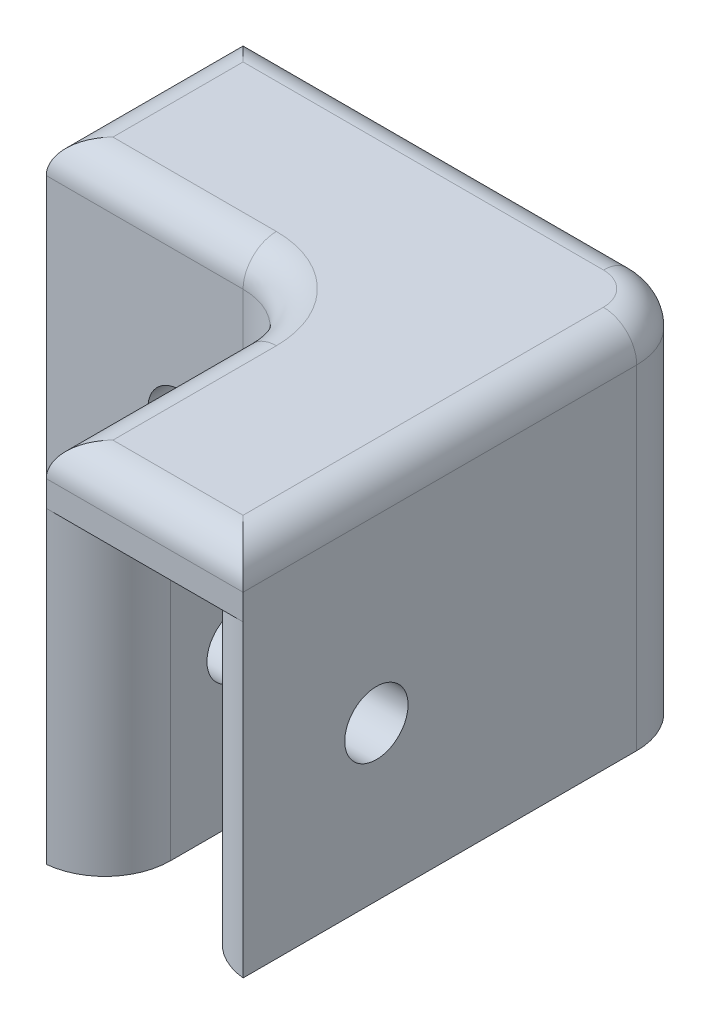
ISO-10303-21;
HEADER;
FILE_DESCRIPTION(('STEP AP214'),'2;1');
FILE_NAME('part.step','',(''),(''),'','','');
FILE_SCHEMA(('AUTOMOTIVE_DESIGN { 1 0 10303 214 1 1 1 1 }'));
ENDSEC;
DATA;
#1=APPLICATION_CONTEXT('core data for automotive mechanical design processes');
#2=APPLICATION_PROTOCOL_DEFINITION('international standard','automotive_design',2000,#1);
#3=PRODUCT_CONTEXT('',#1,'mechanical');
#4=PRODUCT('Part','Part','',(#3));
#5=PRODUCT_RELATED_PRODUCT_CATEGORY('part','',(#4));
#6=PRODUCT_DEFINITION_FORMATION('','',#4);
#7=PRODUCT_DEFINITION_CONTEXT('part definition',#1,'design');
#8=PRODUCT_DEFINITION('design','',#6,#7);
#9=PRODUCT_DEFINITION_SHAPE('','',#8);
#10=(LENGTH_UNIT() NAMED_UNIT(*) SI_UNIT(.MILLI.,.METRE.));
#11=(NAMED_UNIT(*) PLANE_ANGLE_UNIT() SI_UNIT($,.RADIAN.));
#12=(NAMED_UNIT(*) SI_UNIT($,.STERADIAN.) SOLID_ANGLE_UNIT());
#13=UNCERTAINTY_MEASURE_WITH_UNIT(LENGTH_MEASURE(1.E-05),#10,'distance_accuracy_value','');
#14=(GEOMETRIC_REPRESENTATION_CONTEXT(3) GLOBAL_UNCERTAINTY_ASSIGNED_CONTEXT((#13)) GLOBAL_UNIT_ASSIGNED_CONTEXT((#10,
#11,#12)) REPRESENTATION_CONTEXT('',''));
#15=CARTESIAN_POINT('',(0.,0.,0.));
#16=DIRECTION('',(0.,0.,1.));
#17=DIRECTION('',(1.,0.,0.));
#18=AXIS2_PLACEMENT_3D('',#15,#16,#17);
#19=CARTESIAN_POINT('',(0.,0.,0.));
#20=DIRECTION('',(0.,1.,0.));
#21=DIRECTION('',(0.,0.,1.));
#22=AXIS2_PLACEMENT_3D('',#19,#20,#21);
#23=PLANE('',#22);
#24=DIRECTION('',(0.,0.,-1.));
#25=VECTOR('',#24,1.);
#26=CARTESIAN_POINT('',(-10.5,0.,35.));
#27=LINE('',#26,#25);
#28=CARTESIAN_POINT('',(-10.5,0.,30.0250628144669));
#29=VERTEX_POINT('',#28);
#30=CARTESIAN_POINT('',(-10.5,0.,15.5));
#31=VERTEX_POINT('',#30);
#32=EDGE_CURVE('E457',#29,#31,#27,.T.);
#33=ORIENTED_EDGE('',*,*,#32,.F.);
#34=CARTESIAN_POINT('',(-15.5,0.,30.0250628144669));
#35=DIRECTION('',(0.,1.,0.));
#36=DIRECTION('',(0.,0.,1.));
#37=AXIS2_PLACEMENT_3D('',#34,#35,#36);
#38=CIRCLE('',#37,5.);
#39=CARTESIAN_POINT('',(-15.,0.,35.));
#40=VERTEX_POINT('',#39);
#41=EDGE_CURVE('E274',#29,#40,#38,.F.);
#42=ORIENTED_EDGE('',*,*,#41,.T.);
#43=DIRECTION('',(0.,0.,1.));
#44=VECTOR('',#43,1.);
#45=CARTESIAN_POINT('',(-15.,0.,15.));
#46=LINE('',#45,#44);
#47=CARTESIAN_POINT('',(-15.,0.,20.));
#48=VERTEX_POINT('',#47);
#49=EDGE_CURVE('E469',#48,#40,#46,.T.);
#50=ORIENTED_EDGE('',*,*,#49,.F.);
#51=CARTESIAN_POINT('',(-20.,0.,20.));
#52=DIRECTION('',(0.,1.,0.));
#53=DIRECTION('',(0.,0.,1.));
#54=AXIS2_PLACEMENT_3D('',#51,#52,#53);
#55=CIRCLE('',#54,5.);
#56=CARTESIAN_POINT('',(-20.,0.,15.));
#57=VERTEX_POINT('',#56);
#58=EDGE_CURVE('E312',#48,#57,#55,.T.);
#59=ORIENTED_EDGE('',*,*,#58,.T.);
#60=DIRECTION('',(1.,0.,0.));
#61=VECTOR('',#60,1.);
#62=CARTESIAN_POINT('',(-35.,0.,15.));
#63=LINE('',#62,#61);
#64=CARTESIAN_POINT('',(-35.,0.,15.));
#65=VERTEX_POINT('',#64);
#66=EDGE_CURVE('E207',#65,#57,#63,.T.);
#67=ORIENTED_EDGE('',*,*,#66,.F.);
#68=CARTESIAN_POINT('',(-30.0250628144669,0.,15.5));
#69=DIRECTION('',(0.,1.,0.));
#70=DIRECTION('',(0.,0.,1.));
#71=AXIS2_PLACEMENT_3D('',#68,#69,#70);
#72=CIRCLE('',#71,5.);
#73=CARTESIAN_POINT('',(-30.0250628144669,0.,10.5));
#74=VERTEX_POINT('',#73);
#75=EDGE_CURVE('E271',#65,#74,#72,.F.);
#76=ORIENTED_EDGE('',*,*,#75,.T.);
#77=DIRECTION('',(-1.,0.,0.));
#78=VECTOR('',#77,1.);
#79=CARTESIAN_POINT('',(-10.5,0.,10.5));
#80=LINE('',#79,#78);
#81=CARTESIAN_POINT('',(-15.5,0.,10.5));
#82=VERTEX_POINT('',#81);
#83=EDGE_CURVE('E433',#82,#74,#80,.T.);
#84=ORIENTED_EDGE('',*,*,#83,.F.);
#85=CARTESIAN_POINT('',(-15.5,0.,15.5));
#86=DIRECTION('',(0.,1.,0.));
#87=DIRECTION('',(0.,0.,1.));
#88=AXIS2_PLACEMENT_3D('',#85,#86,#87);
#89=CIRCLE('',#88,5.);
#90=EDGE_CURVE('E238',#82,#31,#89,.F.);
#91=ORIENTED_EDGE('',*,*,#90,.T.);
#92=EDGE_LOOP('',(#33,#42,#50,#59,#67,#76,#84,#91));
#93=FACE_BOUND('',#92,.T.);
#94=ADVANCED_FACE('F46',(#93),#23,.F.);
#95=CARTESIAN_POINT('',(0.,28.,0.));
#96=DIRECTION('',(-1.,0.,0.));
#97=DIRECTION('',(0.,0.,1.));
#98=AXIS2_PLACEMENT_3D('',#95,#96,#97);
#99=PLANE('',#98);
#100=CARTESIAN_POINT('',(0.,11.75,24.84));
#101=DIRECTION('',(1.,0.,0.));
#102=DIRECTION('',(0.,0.,-1.));
#103=AXIS2_PLACEMENT_3D('',#100,#101,#102);
#104=CIRCLE('',#103,2.413);
#105=CARTESIAN_POINT('',(0.,11.75,22.427));
#106=VERTEX_POINT('',#105);
#107=EDGE_CURVE('E321',#106,#106,#104,.T.);
#108=ORIENTED_EDGE('',*,*,#107,.F.);
#109=EDGE_LOOP('',(#108));
#110=FACE_BOUND('',#109,.T.);
#111=DIRECTION('',(0.,-1.,0.));
#112=VECTOR('',#111,1.);
#113=CARTESIAN_POINT('',(0.,28.,5.));
#114=LINE('',#113,#112);
#115=CARTESIAN_POINT('',(0.,0.,5.));
#116=VERTEX_POINT('',#115);
#117=CARTESIAN_POINT('',(0.,25.46,5.));
#118=VERTEX_POINT('',#117);
#119=EDGE_CURVE('E302',#116,#118,#114,.F.);
#120=ORIENTED_EDGE('',*,*,#119,.T.);
#121=DIRECTION('',(0.,0.,-1.));
#122=VECTOR('',#121,1.);
#123=CARTESIAN_POINT('',(0.,25.46,35.));
#124=LINE('',#123,#122);
#125=CARTESIAN_POINT('',(0.,25.46,35.));
#126=VERTEX_POINT('',#125);
#127=EDGE_CURVE('E11',#118,#126,#124,.F.);
#128=ORIENTED_EDGE('',*,*,#127,.T.);
#129=DIRECTION('',(0.,-1.,0.));
#130=VECTOR('',#129,1.);
#131=CARTESIAN_POINT('',(0.,28.,35.));
#132=LINE('',#131,#130);
#133=CARTESIAN_POINT('',(0.,23.5,35.));
#134=VERTEX_POINT('',#133);
#135=EDGE_CURVE('E473',#126,#134,#132,.T.);
#136=ORIENTED_EDGE('',*,*,#135,.T.);
#137=CARTESIAN_POINT('',(0.,0.,35.));
#138=VERTEX_POINT('',#137);
#139=EDGE_CURVE('E472',#134,#138,#132,.T.);
#140=ORIENTED_EDGE('',*,*,#139,.T.);
#141=DIRECTION('',(0.,0.,-1.));
#142=VECTOR('',#141,1.);
#143=CARTESIAN_POINT('',(0.,0.,0.));
#144=LINE('',#143,#142);
#145=EDGE_CURVE('E208',#138,#116,#144,.T.);
#146=ORIENTED_EDGE('',*,*,#145,.T.);
#147=EDGE_LOOP('',(#120,#128,#136,#140,#146));
#148=FACE_BOUND('',#147,.T.);
#149=ADVANCED_FACE('F562',(#110,#148),#99,.F.);
#150=CARTESIAN_POINT('',(0.,28.,0.));
#151=DIRECTION('',(0.,0.,1.));
#152=DIRECTION('',(1.,0.,0.));
#153=AXIS2_PLACEMENT_3D('',#150,#151,#152);
#154=PLANE('',#153);
#155=CARTESIAN_POINT('',(-24.84,14.,0.));
#156=DIRECTION('',(0.,0.,-1.));
#157=DIRECTION('',(-1.,0.,0.));
#158=AXIS2_PLACEMENT_3D('',#155,#156,#157);
#159=CIRCLE('',#158,2.413);
#160=CARTESIAN_POINT('',(-27.253,14.,0.));
#161=VERTEX_POINT('',#160);
#162=EDGE_CURVE('E327',#161,#161,#159,.T.);
#163=ORIENTED_EDGE('',*,*,#162,.F.);
#164=EDGE_LOOP('',(#163));
#165=FACE_BOUND('',#164,.T.);
#166=DIRECTION('',(0.,-1.,0.));
#167=VECTOR('',#166,1.);
#168=CARTESIAN_POINT('',(-35.,28.,0.));
#169=LINE('',#168,#167);
#170=CARTESIAN_POINT('',(-35.,25.46,0.));
#171=VERTEX_POINT('',#170);
#172=CARTESIAN_POINT('',(-35.,23.5,0.));
#173=VERTEX_POINT('',#172);
#174=EDGE_CURVE('E225',#171,#173,#169,.T.);
#175=ORIENTED_EDGE('',*,*,#174,.F.);
#176=DIRECTION('',(-1.,0.,0.));
#177=VECTOR('',#176,1.);
#178=CARTESIAN_POINT('',(-5.,25.46,0.));
#179=LINE('',#178,#177);
#180=CARTESIAN_POINT('',(-5.,25.46,0.));
#181=VERTEX_POINT('',#180);
#182=EDGE_CURVE('E71',#171,#181,#179,.F.);
#183=ORIENTED_EDGE('',*,*,#182,.T.);
#184=DIRECTION('',(0.,-1.,0.));
#185=VECTOR('',#184,1.);
#186=CARTESIAN_POINT('',(-5.,28.,0.));
#187=LINE('',#186,#185);
#188=CARTESIAN_POINT('',(-5.,0.,0.));
#189=VERTEX_POINT('',#188);
#190=EDGE_CURVE('E203',#181,#189,#187,.T.);
#191=ORIENTED_EDGE('',*,*,#190,.T.);
#192=DIRECTION('',(-1.,0.,0.));
#193=VECTOR('',#192,1.);
#194=CARTESIAN_POINT('',(0.,0.,0.));
#195=LINE('',#194,#193);
#196=CARTESIAN_POINT('',(-35.,0.,0.));
#197=VERTEX_POINT('',#196);
#198=EDGE_CURVE('E197',#189,#197,#195,.T.);
#199=ORIENTED_EDGE('',*,*,#198,.T.);
#200=EDGE_CURVE('E201',#173,#197,#169,.T.);
#201=ORIENTED_EDGE('',*,*,#200,.F.);
#202=EDGE_LOOP('',(#175,#183,#191,#199,#201));
#203=FACE_BOUND('',#202,.T.);
#204=ADVANCED_FACE('F199',(#165,#203),#154,.F.);
#205=CARTESIAN_POINT('',(-35.,28.,0.));
#206=DIRECTION('',(1.,0.,0.));
#207=DIRECTION('',(0.,0.,-1.));
#208=AXIS2_PLACEMENT_3D('',#205,#206,#207);
#209=PLANE('',#208);
#210=DIRECTION('',(0.,-1.,0.));
#211=VECTOR('',#210,1.);
#212=CARTESIAN_POINT('',(-35.,28.,15.));
#213=LINE('',#212,#211);
#214=CARTESIAN_POINT('',(-35.,25.46,15.));
#215=VERTEX_POINT('',#214);
#216=CARTESIAN_POINT('',(-35.,23.5,15.));
#217=VERTEX_POINT('',#216);
#218=EDGE_CURVE('E226',#215,#217,#213,.T.);
#219=ORIENTED_EDGE('',*,*,#218,.F.);
#220=DIRECTION('',(0.,0.,1.));
#221=VECTOR('',#220,1.);
#222=CARTESIAN_POINT('',(-35.,25.46,0.));
#223=LINE('',#222,#221);
#224=EDGE_CURVE('E365',#215,#171,#223,.F.);
#225=ORIENTED_EDGE('',*,*,#224,.T.);
#226=ORIENTED_EDGE('',*,*,#174,.T.);
#227=DIRECTION('',(0.,0.,-1.));
#228=VECTOR('',#227,1.);
#229=CARTESIAN_POINT('',(-35.,23.5,10.5));
#230=LINE('',#229,#228);
#231=EDGE_CURVE('E428',#217,#173,#230,.T.);
#232=ORIENTED_EDGE('',*,*,#231,.F.);
#233=EDGE_LOOP('',(#219,#225,#226,#232));
#234=FACE_BOUND('',#233,.T.);
#235=ADVANCED_FACE('F546',(#234),#209,.F.);
#236=CARTESIAN_POINT('',(-35.,28.,15.));
#237=DIRECTION('',(0.,0.,-1.));
#238=DIRECTION('',(-1.,0.,0.));
#239=AXIS2_PLACEMENT_3D('',#236,#237,#238);
#240=PLANE('',#239);
#241=CARTESIAN_POINT('',(-24.84,14.,15.));
#242=DIRECTION('',(0.,0.,-1.));
#243=DIRECTION('',(-1.,0.,0.));
#244=AXIS2_PLACEMENT_3D('',#241,#242,#243);
#245=CIRCLE('',#244,2.413);
#246=CARTESIAN_POINT('',(-27.253,14.,15.));
#247=VERTEX_POINT('',#246);
#248=EDGE_CURVE('E414',#247,#247,#245,.T.);
#249=ORIENTED_EDGE('',*,*,#248,.T.);
#250=EDGE_LOOP('',(#249));
#251=FACE_BOUND('',#250,.T.);
#252=DIRECTION('',(0.,-1.,0.));
#253=VECTOR('',#252,1.);
#254=CARTESIAN_POINT('',(-20.,28.,15.));
#255=LINE('',#254,#253);
#256=CARTESIAN_POINT('',(-20.,25.46,15.));
#257=VERTEX_POINT('',#256);
#258=EDGE_CURVE('E308',#57,#257,#255,.F.);
#259=ORIENTED_EDGE('',*,*,#258,.T.);
#260=DIRECTION('',(1.,0.,0.));
#261=VECTOR('',#260,1.);
#262=CARTESIAN_POINT('',(-35.,25.46,15.));
#263=LINE('',#262,#261);
#264=EDGE_CURVE('E362',#257,#215,#263,.F.);
#265=ORIENTED_EDGE('',*,*,#264,.T.);
#266=ORIENTED_EDGE('',*,*,#218,.T.);
#267=EDGE_CURVE('E231',#217,#65,#213,.T.);
#268=ORIENTED_EDGE('',*,*,#267,.T.);
#269=ORIENTED_EDGE('',*,*,#66,.T.);
#270=EDGE_LOOP('',(#259,#265,#266,#268,#269));
#271=FACE_BOUND('',#270,.T.);
#272=ADVANCED_FACE('F542',(#251,#271),#240,.F.);
#273=CARTESIAN_POINT('',(-15.,28.,15.));
#274=DIRECTION('',(1.,0.,0.));
#275=DIRECTION('',(0.,0.,-1.));
#276=AXIS2_PLACEMENT_3D('',#273,#274,#275);
#277=PLANE('',#276);
#278=CARTESIAN_POINT('',(-15.,11.75,24.84));
#279=DIRECTION('',(1.,0.,0.));
#280=DIRECTION('',(0.,0.,-1.));
#281=AXIS2_PLACEMENT_3D('',#278,#279,#280);
#282=CIRCLE('',#281,2.413);
#283=CARTESIAN_POINT('',(-15.,11.75,22.427));
#284=VERTEX_POINT('',#283);
#285=EDGE_CURVE('E424',#284,#284,#282,.T.);
#286=ORIENTED_EDGE('',*,*,#285,.T.);
#287=EDGE_LOOP('',(#286));
#288=FACE_BOUND('',#287,.T.);
#289=DIRECTION('',(0.,-1.,0.));
#290=VECTOR('',#289,1.);
#291=CARTESIAN_POINT('',(-15.,28.,35.));
#292=LINE('',#291,#290);
#293=CARTESIAN_POINT('',(-15.,25.46,35.));
#294=VERTEX_POINT('',#293);
#295=CARTESIAN_POINT('',(-15.,23.5,35.));
#296=VERTEX_POINT('',#295);
#297=EDGE_CURVE('E476',#294,#296,#292,.T.);
#298=ORIENTED_EDGE('',*,*,#297,.F.);
#299=DIRECTION('',(0.,0.,1.));
#300=VECTOR('',#299,1.);
#301=CARTESIAN_POINT('',(-15.,25.46,20.));
#302=LINE('',#301,#300);
#303=CARTESIAN_POINT('',(-15.,25.46,20.));
#304=VERTEX_POINT('',#303);
#305=EDGE_CURVE('E356',#294,#304,#302,.F.);
#306=ORIENTED_EDGE('',*,*,#305,.T.);
#307=DIRECTION('',(0.,-1.,0.));
#308=VECTOR('',#307,1.);
#309=CARTESIAN_POINT('',(-15.,0.,20.));
#310=LINE('',#309,#308);
#311=EDGE_CURVE('E305',#304,#48,#310,.T.);
#312=ORIENTED_EDGE('',*,*,#311,.T.);
#313=ORIENTED_EDGE('',*,*,#49,.T.);
#314=EDGE_CURVE('E475',#296,#40,#292,.T.);
#315=ORIENTED_EDGE('',*,*,#314,.F.);
#316=EDGE_LOOP('',(#298,#306,#312,#313,#315));
#317=FACE_BOUND('',#316,.T.);
#318=ADVANCED_FACE('F491',(#288,#317),#277,.F.);
#319=CARTESIAN_POINT('',(-15.,28.,35.));
#320=DIRECTION('',(0.,0.,-1.));
#321=DIRECTION('',(-1.,0.,0.));
#322=AXIS2_PLACEMENT_3D('',#319,#320,#321);
#323=PLANE('',#322);
#324=ORIENTED_EDGE('',*,*,#135,.F.);
#325=DIRECTION('',(1.,0.,0.));
#326=VECTOR('',#325,1.);
#327=CARTESIAN_POINT('',(-15.,25.46,35.));
#328=LINE('',#327,#326);
#329=EDGE_CURVE('E352',#126,#294,#328,.F.);
#330=ORIENTED_EDGE('',*,*,#329,.T.);
#331=ORIENTED_EDGE('',*,*,#297,.T.);
#332=DIRECTION('',(-1.,0.,0.));
#333=VECTOR('',#332,1.);
#334=CARTESIAN_POINT('',(-4.49999999999999,23.5,35.));
#335=LINE('',#334,#333);
#336=EDGE_CURVE('E440',#134,#296,#335,.T.);
#337=ORIENTED_EDGE('',*,*,#336,.F.);
#338=EDGE_LOOP('',(#324,#330,#331,#337));
#339=FACE_BOUND('',#338,.T.);
#340=ADVANCED_FACE('F509',(#339),#323,.F.);
#341=CARTESIAN_POINT('',(0.,28.,0.));
#342=DIRECTION('',(0.,1.,0.));
#343=DIRECTION('',(0.,0.,1.));
#344=AXIS2_PLACEMENT_3D('',#341,#342,#343);
#345=PLANE('',#344);
#346=DIRECTION('',(0.,0.,1.));
#347=VECTOR('',#346,1.);
#348=CARTESIAN_POINT('',(-12.46,28.,35.));
#349=LINE('',#348,#347);
#350=CARTESIAN_POINT('',(-12.46,28.,20.));
#351=VERTEX_POINT('',#350);
#352=CARTESIAN_POINT('',(-12.46,28.,32.46));
#353=VERTEX_POINT('',#352);
#354=EDGE_CURVE('E345',#351,#353,#349,.T.);
#355=ORIENTED_EDGE('',*,*,#354,.T.);
#356=DIRECTION('',(1.,0.,0.));
#357=VECTOR('',#356,1.);
#358=CARTESIAN_POINT('',(0.,28.,32.46));
#359=LINE('',#358,#357);
#360=CARTESIAN_POINT('',(-2.54,28.,32.46));
#361=VERTEX_POINT('',#360);
#362=EDGE_CURVE('E348',#353,#361,#359,.T.);
#363=ORIENTED_EDGE('',*,*,#362,.T.);
#364=DIRECTION('',(0.,0.,-1.));
#365=VECTOR('',#364,1.);
#366=CARTESIAN_POINT('',(-2.54,28.,5.));
#367=LINE('',#366,#365);
#368=CARTESIAN_POINT('',(-2.54,28.,5.));
#369=VERTEX_POINT('',#368);
#370=EDGE_CURVE('E315',#361,#369,#367,.T.);
#371=ORIENTED_EDGE('',*,*,#370,.T.);
#372=CARTESIAN_POINT('',(-5.,28.,5.));
#373=DIRECTION('',(0.,1.,0.));
#374=DIRECTION('',(0.,0.,1.));
#375=AXIS2_PLACEMENT_3D('',#372,#373,#374);
#376=CIRCLE('',#375,2.46);
#377=CARTESIAN_POINT('',(-5.,28.,2.54));
#378=VERTEX_POINT('',#377);
#379=EDGE_CURVE('E330',#369,#378,#376,.T.);
#380=ORIENTED_EDGE('',*,*,#379,.T.);
#381=DIRECTION('',(-1.,0.,0.));
#382=VECTOR('',#381,1.);
#383=CARTESIAN_POINT('',(-35.,28.,2.54));
#384=LINE('',#383,#382);
#385=CARTESIAN_POINT('',(-32.46,28.,2.54));
#386=VERTEX_POINT('',#385);
#387=EDGE_CURVE('E333',#378,#386,#384,.T.);
#388=ORIENTED_EDGE('',*,*,#387,.T.);
#389=DIRECTION('',(0.,0.,1.));
#390=VECTOR('',#389,1.);
#391=CARTESIAN_POINT('',(-32.46,28.,15.));
#392=LINE('',#391,#390);
#393=CARTESIAN_POINT('',(-32.46,28.,12.46));
#394=VERTEX_POINT('',#393);
#395=EDGE_CURVE('E336',#386,#394,#392,.T.);
#396=ORIENTED_EDGE('',*,*,#395,.T.);
#397=DIRECTION('',(1.,0.,0.));
#398=VECTOR('',#397,1.);
#399=CARTESIAN_POINT('',(-20.,28.,12.46));
#400=LINE('',#399,#398);
#401=CARTESIAN_POINT('',(-20.,28.,12.46));
#402=VERTEX_POINT('',#401);
#403=EDGE_CURVE('E339',#394,#402,#400,.T.);
#404=ORIENTED_EDGE('',*,*,#403,.T.);
#405=CARTESIAN_POINT('',(-20.,28.,20.));
#406=DIRECTION('',(0.,1.,0.));
#407=DIRECTION('',(0.,0.,1.));
#408=AXIS2_PLACEMENT_3D('',#405,#406,#407);
#409=CIRCLE('',#408,7.54);
#410=EDGE_CURVE('E342',#402,#351,#409,.F.);
#411=ORIENTED_EDGE('',*,*,#410,.T.);
#412=EDGE_LOOP('',(#355,#363,#371,#380,#388,#396,#404,#411));
#413=FACE_BOUND('',#412,.T.);
#414=ADVANCED_FACE('F526',(#413),#345,.T.);
#415=ORIENTED_EDGE('',*,*,#198,.F.);
#416=CARTESIAN_POINT('',(-5.,0.,5.));
#417=DIRECTION('',(0.,1.,0.));
#418=DIRECTION('',(0.,0.,1.));
#419=AXIS2_PLACEMENT_3D('',#416,#417,#418);
#420=CIRCLE('',#419,5.);
#421=EDGE_CURVE('E299',#189,#116,#420,.F.);
#422=ORIENTED_EDGE('',*,*,#421,.T.);
#423=ORIENTED_EDGE('',*,*,#145,.F.);
#424=CARTESIAN_POINT('',(0.500000000000009,0.,30.0250628144669));
#425=DIRECTION('',(0.,1.,0.));
#426=DIRECTION('',(0.,0.,1.));
#427=AXIS2_PLACEMENT_3D('',#424,#425,#426);
#428=CIRCLE('',#427,5.);
#429=CARTESIAN_POINT('',(-4.49999999999999,0.,30.0250628144669));
#430=VERTEX_POINT('',#429);
#431=EDGE_CURVE('E219',#138,#430,#428,.F.);
#432=ORIENTED_EDGE('',*,*,#431,.T.);
#433=DIRECTION('',(0.,0.,1.));
#434=VECTOR('',#433,1.);
#435=CARTESIAN_POINT('',(-4.49999999999999,0.,4.50000000000001));
#436=LINE('',#435,#434);
#437=CARTESIAN_POINT('',(-4.49999999999999,0.,9.50000000000001));
#438=VERTEX_POINT('',#437);
#439=EDGE_CURVE('E453',#438,#430,#436,.T.);
#440=ORIENTED_EDGE('',*,*,#439,.F.);
#441=CARTESIAN_POINT('',(-9.49999999999999,0.,9.50000000000001));
#442=DIRECTION('',(0.,1.,0.));
#443=DIRECTION('',(0.,0.,1.));
#444=AXIS2_PLACEMENT_3D('',#441,#442,#443);
#445=CIRCLE('',#444,5.);
#446=CARTESIAN_POINT('',(-9.5,0.,4.50000000000001));
#447=VERTEX_POINT('',#446);
#448=EDGE_CURVE('E220',#438,#447,#445,.T.);
#449=ORIENTED_EDGE('',*,*,#448,.T.);
#450=DIRECTION('',(1.,0.,0.));
#451=VECTOR('',#450,1.);
#452=CARTESIAN_POINT('',(-35.,0.,4.50000000000001));
#453=LINE('',#452,#451);
#454=CARTESIAN_POINT('',(-30.0250628144669,0.,4.50000000000001));
#455=VERTEX_POINT('',#454);
#456=EDGE_CURVE('E214',#455,#447,#453,.T.);
#457=ORIENTED_EDGE('',*,*,#456,.F.);
#458=CARTESIAN_POINT('',(-30.0250628144669,0.,-0.499999999999993));
#459=DIRECTION('',(0.,1.,0.));
#460=DIRECTION('',(0.,0.,1.));
#461=AXIS2_PLACEMENT_3D('',#458,#459,#460);
#462=CIRCLE('',#461,5.);
#463=EDGE_CURVE('E211',#455,#197,#462,.F.);
#464=ORIENTED_EDGE('',*,*,#463,.T.);
#465=EDGE_LOOP('',(#415,#422,#423,#432,#440,#449,#457,#464));
#466=FACE_BOUND('',#465,.T.);
#467=ADVANCED_FACE('F212',(#466),#23,.F.);
#468=CARTESIAN_POINT('',(-10.5,23.5,10.5));
#469=DIRECTION('',(0.,0.,1.));
#470=DIRECTION('',(1.,0.,0.));
#471=AXIS2_PLACEMENT_3D('',#468,#469,#470);
#472=PLANE('',#471);
#473=CARTESIAN_POINT('',(-24.84,14.,10.5));
#474=DIRECTION('',(0.,0.,1.));
#475=DIRECTION('',(1.,0.,0.));
#476=AXIS2_PLACEMENT_3D('',#473,#474,#475);
#477=CIRCLE('',#476,2.413);
#478=CARTESIAN_POINT('',(-22.427,14.,10.5));
#479=VERTEX_POINT('',#478);
#480=EDGE_CURVE('E326',#479,#479,#477,.T.);
#481=ORIENTED_EDGE('',*,*,#480,.T.);
#482=EDGE_LOOP('',(#481));
#483=FACE_BOUND('',#482,.T.);
#484=ORIENTED_EDGE('',*,*,#83,.T.);
#485=DIRECTION('',(0.,1.,0.));
#486=VECTOR('',#485,1.);
#487=CARTESIAN_POINT('',(-30.0250628144669,23.5,10.5));
#488=LINE('',#487,#486);
#489=CARTESIAN_POINT('',(-30.0250628144669,23.5,10.5));
#490=VERTEX_POINT('',#489);
#491=EDGE_CURVE('E278',#74,#490,#488,.T.);
#492=ORIENTED_EDGE('',*,*,#491,.T.);
#493=DIRECTION('',(-1.,0.,0.));
#494=VECTOR('',#493,1.);
#495=CARTESIAN_POINT('',(-10.5,23.5,10.5));
#496=LINE('',#495,#494);
#497=CARTESIAN_POINT('',(-15.5,23.5,10.5));
#498=VERTEX_POINT('',#497);
#499=EDGE_CURVE('E447',#498,#490,#496,.T.);
#500=ORIENTED_EDGE('',*,*,#499,.F.);
#501=DIRECTION('',(0.,-1.,0.));
#502=VECTOR('',#501,1.);
#503=CARTESIAN_POINT('',(-15.5,23.5,10.5));
#504=LINE('',#503,#502);
#505=EDGE_CURVE('E230',#498,#82,#504,.T.);
#506=ORIENTED_EDGE('',*,*,#505,.T.);
#507=EDGE_LOOP('',(#484,#492,#500,#506));
#508=FACE_BOUND('',#507,.T.);
#509=ADVANCED_FACE('F573',(#483,#508),#472,.F.);
#510=CARTESIAN_POINT('',(-10.5,23.5,35.));
#511=DIRECTION('',(-1.,0.,0.));
#512=DIRECTION('',(0.,0.,1.));
#513=AXIS2_PLACEMENT_3D('',#510,#511,#512);
#514=PLANE('',#513);
#515=CARTESIAN_POINT('',(-10.5,11.75,24.84));
#516=DIRECTION('',(-1.,0.,0.));
#517=DIRECTION('',(0.,0.,1.));
#518=AXIS2_PLACEMENT_3D('',#515,#516,#517);
#519=CIRCLE('',#518,2.413);
#520=CARTESIAN_POINT('',(-10.5,11.75,27.253));
#521=VERTEX_POINT('',#520);
#522=EDGE_CURVE('E320',#521,#521,#519,.T.);
#523=ORIENTED_EDGE('',*,*,#522,.T.);
#524=EDGE_LOOP('',(#523));
#525=FACE_BOUND('',#524,.T.);
#526=DIRECTION('',(0.,0.,-1.));
#527=VECTOR('',#526,1.);
#528=CARTESIAN_POINT('',(-10.5,23.5,35.));
#529=LINE('',#528,#527);
#530=CARTESIAN_POINT('',(-10.5,23.5,30.0250628144669));
#531=VERTEX_POINT('',#530);
#532=CARTESIAN_POINT('',(-10.5,23.5,15.5));
#533=VERTEX_POINT('',#532);
#534=EDGE_CURVE('E444',#531,#533,#529,.T.);
#535=ORIENTED_EDGE('',*,*,#534,.F.);
#536=DIRECTION('',(0.,-1.,0.));
#537=VECTOR('',#536,1.);
#538=CARTESIAN_POINT('',(-10.5,23.5,30.0250628144669));
#539=LINE('',#538,#537);
#540=EDGE_CURVE('E267',#531,#29,#539,.T.);
#541=ORIENTED_EDGE('',*,*,#540,.T.);
#542=ORIENTED_EDGE('',*,*,#32,.T.);
#543=DIRECTION('',(0.,-1.,0.));
#544=VECTOR('',#543,1.);
#545=CARTESIAN_POINT('',(-10.5,23.5,15.5));
#546=LINE('',#545,#544);
#547=EDGE_CURVE('E242',#31,#533,#546,.F.);
#548=ORIENTED_EDGE('',*,*,#547,.T.);
#549=EDGE_LOOP('',(#535,#541,#542,#548));
#550=FACE_BOUND('',#549,.T.);
#551=ADVANCED_FACE('F501',(#525,#550),#514,.F.);
#552=CARTESIAN_POINT('',(-4.49999999999999,23.5,4.50000000000001));
#553=DIRECTION('',(1.,0.,0.));
#554=DIRECTION('',(0.,0.,-1.));
#555=AXIS2_PLACEMENT_3D('',#552,#553,#554);
#556=PLANE('',#555);
#557=CARTESIAN_POINT('',(-4.49999999999999,11.75,24.84));
#558=DIRECTION('',(1.,0.,0.));
#559=DIRECTION('',(0.,0.,-1.));
#560=AXIS2_PLACEMENT_3D('',#557,#558,#559);
#561=CIRCLE('',#560,2.413);
#562=CARTESIAN_POINT('',(-4.49999999999999,11.75,22.427));
#563=VERTEX_POINT('',#562);
#564=EDGE_CURVE('E316',#563,#563,#561,.T.);
#565=ORIENTED_EDGE('',*,*,#564,.T.);
#566=EDGE_LOOP('',(#565));
#567=FACE_BOUND('',#566,.T.);
#568=ORIENTED_EDGE('',*,*,#439,.T.);
#569=DIRECTION('',(0.,1.,0.));
#570=VECTOR('',#569,1.);
#571=CARTESIAN_POINT('',(-4.49999999999999,23.5,30.0250628144669));
#572=LINE('',#571,#570);
#573=CARTESIAN_POINT('',(-4.49999999999999,23.5,30.0250628144669));
#574=VERTEX_POINT('',#573);
#575=EDGE_CURVE('E264',#430,#574,#572,.T.);
#576=ORIENTED_EDGE('',*,*,#575,.T.);
#577=DIRECTION('',(0.,0.,1.));
#578=VECTOR('',#577,1.);
#579=CARTESIAN_POINT('',(-4.49999999999999,23.5,4.50000000000001));
#580=LINE('',#579,#578);
#581=CARTESIAN_POINT('',(-4.49999999999999,23.5,9.50000000000001));
#582=VERTEX_POINT('',#581);
#583=EDGE_CURVE('E436',#582,#574,#580,.T.);
#584=ORIENTED_EDGE('',*,*,#583,.F.);
#585=DIRECTION('',(0.,-1.,0.));
#586=VECTOR('',#585,1.);
#587=CARTESIAN_POINT('',(-4.49999999999999,0.,9.50000000000001));
#588=LINE('',#587,#586);
#589=EDGE_CURVE('E246',#582,#438,#588,.T.);
#590=ORIENTED_EDGE('',*,*,#589,.T.);
#591=EDGE_LOOP('',(#568,#576,#584,#590));
#592=FACE_BOUND('',#591,.T.);
#593=ADVANCED_FACE('F589',(#567,#592),#556,.F.);
#594=CARTESIAN_POINT('',(-35.,23.5,4.50000000000001));
#595=DIRECTION('',(0.,0.,-1.));
#596=DIRECTION('',(-1.,0.,0.));
#597=AXIS2_PLACEMENT_3D('',#594,#595,#596);
#598=PLANE('',#597);
#599=CARTESIAN_POINT('',(-24.84,14.,4.50000000000001));
#600=DIRECTION('',(0.,0.,-1.));
#601=DIRECTION('',(-1.,0.,0.));
#602=AXIS2_PLACEMENT_3D('',#599,#600,#601);
#603=CIRCLE('',#602,2.413);
#604=CARTESIAN_POINT('',(-27.253,14.,4.50000000000001));
#605=VERTEX_POINT('',#604);
#606=EDGE_CURVE('E322',#605,#605,#603,.T.);
#607=ORIENTED_EDGE('',*,*,#606,.T.);
#608=EDGE_LOOP('',(#607));
#609=FACE_BOUND('',#608,.T.);
#610=DIRECTION('',(1.,0.,0.));
#611=VECTOR('',#610,1.);
#612=CARTESIAN_POINT('',(-35.,23.5,4.50000000000001));
#613=LINE('',#612,#611);
#614=CARTESIAN_POINT('',(-30.0250628144669,23.5,4.50000000000001));
#615=VERTEX_POINT('',#614);
#616=CARTESIAN_POINT('',(-9.5,23.5,4.50000000000001));
#617=VERTEX_POINT('',#616);
#618=EDGE_CURVE('E432',#615,#617,#613,.T.);
#619=ORIENTED_EDGE('',*,*,#618,.F.);
#620=DIRECTION('',(0.,-1.,0.));
#621=VECTOR('',#620,1.);
#622=CARTESIAN_POINT('',(-30.0250628144669,23.5,4.50000000000001));
#623=LINE('',#622,#621);
#624=EDGE_CURVE('E281',#615,#455,#623,.T.);
#625=ORIENTED_EDGE('',*,*,#624,.T.);
#626=ORIENTED_EDGE('',*,*,#456,.T.);
#627=DIRECTION('',(0.,-1.,0.));
#628=VECTOR('',#627,1.);
#629=CARTESIAN_POINT('',(-9.49999999999999,23.5,4.50000000000001));
#630=LINE('',#629,#628);
#631=EDGE_CURVE('E250',#447,#617,#630,.F.);
#632=ORIENTED_EDGE('',*,*,#631,.T.);
#633=EDGE_LOOP('',(#619,#625,#626,#632));
#634=FACE_BOUND('',#633,.T.);
#635=ADVANCED_FACE('F586',(#609,#634),#598,.F.);
#636=CARTESIAN_POINT('',(0.,23.5,0.));
#637=DIRECTION('',(0.,-1.,0.));
#638=DIRECTION('',(0.,0.,-1.));
#639=AXIS2_PLACEMENT_3D('',#636,#637,#638);
#640=PLANE('',#639);
#641=ORIENTED_EDGE('',*,*,#231,.T.);
#642=CARTESIAN_POINT('',(-30.0250628144669,23.5,-0.499999999999993));
#643=DIRECTION('',(0.,-1.,0.));
#644=DIRECTION('',(0.,0.,-1.));
#645=AXIS2_PLACEMENT_3D('',#642,#643,#644);
#646=CIRCLE('',#645,5.);
#647=EDGE_CURVE('E223',#173,#615,#646,.F.);
#648=ORIENTED_EDGE('',*,*,#647,.T.);
#649=ORIENTED_EDGE('',*,*,#618,.T.);
#650=CARTESIAN_POINT('',(-9.49999999999999,23.5,9.50000000000001));
#651=DIRECTION('',(0.,-1.,0.));
#652=DIRECTION('',(0.,0.,-1.));
#653=AXIS2_PLACEMENT_3D('',#650,#651,#652);
#654=CIRCLE('',#653,5.);
#655=EDGE_CURVE('E254',#617,#582,#654,.T.);
#656=ORIENTED_EDGE('',*,*,#655,.T.);
#657=ORIENTED_EDGE('',*,*,#583,.T.);
#658=CARTESIAN_POINT('',(0.500000000000009,23.5,30.0250628144669));
#659=DIRECTION('',(0.,-1.,0.));
#660=DIRECTION('',(0.,0.,-1.));
#661=AXIS2_PLACEMENT_3D('',#658,#659,#660);
#662=CIRCLE('',#661,5.);
#663=EDGE_CURVE('E284',#574,#134,#662,.F.);
#664=ORIENTED_EDGE('',*,*,#663,.T.);
#665=ORIENTED_EDGE('',*,*,#336,.T.);
#666=CARTESIAN_POINT('',(-15.5,23.5,30.0250628144669));
#667=DIRECTION('',(0.,-1.,0.));
#668=DIRECTION('',(0.,0.,-1.));
#669=AXIS2_PLACEMENT_3D('',#666,#667,#668);
#670=CIRCLE('',#669,5.);
#671=EDGE_CURVE('E288',#296,#531,#670,.F.);
#672=ORIENTED_EDGE('',*,*,#671,.T.);
#673=ORIENTED_EDGE('',*,*,#534,.T.);
#674=CARTESIAN_POINT('',(-15.5,23.5,15.5));
#675=DIRECTION('',(0.,-1.,0.));
#676=DIRECTION('',(0.,0.,-1.));
#677=AXIS2_PLACEMENT_3D('',#674,#675,#676);
#678=CIRCLE('',#677,5.);
#679=EDGE_CURVE('E257',#533,#498,#678,.F.);
#680=ORIENTED_EDGE('',*,*,#679,.T.);
#681=ORIENTED_EDGE('',*,*,#499,.T.);
#682=CARTESIAN_POINT('',(-30.0250628144669,23.5,15.5));
#683=DIRECTION('',(0.,-1.,0.));
#684=DIRECTION('',(0.,0.,-1.));
#685=AXIS2_PLACEMENT_3D('',#682,#683,#684);
#686=CIRCLE('',#685,5.);
#687=EDGE_CURVE('E291',#490,#217,#686,.F.);
#688=ORIENTED_EDGE('',*,*,#687,.T.);
#689=EDGE_LOOP('',(#641,#648,#649,#656,#657,#664,#665,#672,#673,#680,#681,#688));
#690=FACE_BOUND('',#689,.T.);
#691=ADVANCED_FACE('F504',(#690),#640,.T.);
#692=CARTESIAN_POINT('',(-15.5,23.5,15.5));
#693=DIRECTION('',(0.,-1.,0.));
#694=DIRECTION('',(0.,0.,-1.));
#695=AXIS2_PLACEMENT_3D('',#692,#693,#694);
#696=CYLINDRICAL_SURFACE('',#695,5.);
#697=ORIENTED_EDGE('',*,*,#679,.F.);
#698=ORIENTED_EDGE('',*,*,#547,.F.);
#699=ORIENTED_EDGE('',*,*,#90,.F.);
#700=ORIENTED_EDGE('',*,*,#505,.F.);
#701=EDGE_LOOP('',(#697,#698,#699,#700));
#702=FACE_BOUND('',#701,.T.);
#703=ADVANCED_FACE('F598',(#702),#696,.T.);
#704=CARTESIAN_POINT('',(-9.49999999999999,23.5,9.50000000000001));
#705=DIRECTION('',(0.,1.,0.));
#706=DIRECTION('',(0.,0.,1.));
#707=AXIS2_PLACEMENT_3D('',#704,#705,#706);
#708=CYLINDRICAL_SURFACE('',#707,5.);
#709=ORIENTED_EDGE('',*,*,#655,.F.);
#710=ORIENTED_EDGE('',*,*,#631,.F.);
#711=ORIENTED_EDGE('',*,*,#448,.F.);
#712=ORIENTED_EDGE('',*,*,#589,.F.);
#713=EDGE_LOOP('',(#709,#710,#711,#712));
#714=FACE_BOUND('',#713,.T.);
#715=ADVANCED_FACE('F631',(#714),#708,.F.);
#716=CARTESIAN_POINT('',(0.500000000000009,28.,30.0250628144669));
#717=DIRECTION('',(0.,1.,0.));
#718=DIRECTION('',(0.,0.,1.));
#719=AXIS2_PLACEMENT_3D('',#716,#717,#718);
#720=CYLINDRICAL_SURFACE('',#719,5.);
#721=ORIENTED_EDGE('',*,*,#663,.F.);
#722=ORIENTED_EDGE('',*,*,#575,.F.);
#723=ORIENTED_EDGE('',*,*,#431,.F.);
#724=ORIENTED_EDGE('',*,*,#139,.F.);
#725=EDGE_LOOP('',(#721,#722,#723,#724));
#726=FACE_BOUND('',#725,.T.);
#727=ADVANCED_FACE('F635',(#726),#720,.T.);
#728=CARTESIAN_POINT('',(-15.5,28.,30.0250628144669));
#729=DIRECTION('',(0.,-1.,0.));
#730=DIRECTION('',(0.,0.,-1.));
#731=AXIS2_PLACEMENT_3D('',#728,#729,#730);
#732=CYLINDRICAL_SURFACE('',#731,5.);
#733=ORIENTED_EDGE('',*,*,#671,.F.);
#734=ORIENTED_EDGE('',*,*,#314,.T.);
#735=ORIENTED_EDGE('',*,*,#41,.F.);
#736=ORIENTED_EDGE('',*,*,#540,.F.);
#737=EDGE_LOOP('',(#733,#734,#735,#736));
#738=FACE_BOUND('',#737,.T.);
#739=ADVANCED_FACE('F488',(#738),#732,.T.);
#740=CARTESIAN_POINT('',(-30.0250628144669,28.,15.5));
#741=DIRECTION('',(0.,1.,0.));
#742=DIRECTION('',(0.,0.,1.));
#743=AXIS2_PLACEMENT_3D('',#740,#741,#742);
#744=CYLINDRICAL_SURFACE('',#743,5.);
#745=ORIENTED_EDGE('',*,*,#687,.F.);
#746=ORIENTED_EDGE('',*,*,#491,.F.);
#747=ORIENTED_EDGE('',*,*,#75,.F.);
#748=ORIENTED_EDGE('',*,*,#267,.F.);
#749=EDGE_LOOP('',(#745,#746,#747,#748));
#750=FACE_BOUND('',#749,.T.);
#751=ADVANCED_FACE('F642',(#750),#744,.T.);
#752=CARTESIAN_POINT('',(-30.0250628144669,28.,-0.499999999999993));
#753=DIRECTION('',(0.,-1.,0.));
#754=DIRECTION('',(0.,0.,-1.));
#755=AXIS2_PLACEMENT_3D('',#752,#753,#754);
#756=CYLINDRICAL_SURFACE('',#755,5.);
#757=ORIENTED_EDGE('',*,*,#647,.F.);
#758=ORIENTED_EDGE('',*,*,#200,.T.);
#759=ORIENTED_EDGE('',*,*,#463,.F.);
#760=ORIENTED_EDGE('',*,*,#624,.F.);
#761=EDGE_LOOP('',(#757,#758,#759,#760));
#762=FACE_BOUND('',#761,.T.);
#763=ADVANCED_FACE('F222',(#762),#756,.T.);
#764=CARTESIAN_POINT('',(-5.,28.,5.));
#765=DIRECTION('',(0.,-1.,0.));
#766=DIRECTION('',(0.,0.,-1.));
#767=AXIS2_PLACEMENT_3D('',#764,#765,#766);
#768=CYLINDRICAL_SURFACE('',#767,5.);
#769=ORIENTED_EDGE('',*,*,#190,.F.);
#770=CARTESIAN_POINT('',(-5.,25.46,5.));
#771=DIRECTION('',(0.,1.,0.));
#772=DIRECTION('',(0.,0.,1.));
#773=AXIS2_PLACEMENT_3D('',#770,#771,#772);
#774=CIRCLE('',#773,5.);
#775=EDGE_CURVE('E56',#181,#118,#774,.F.);
#776=ORIENTED_EDGE('',*,*,#775,.T.);
#777=ORIENTED_EDGE('',*,*,#119,.F.);
#778=ORIENTED_EDGE('',*,*,#421,.F.);
#779=EDGE_LOOP('',(#769,#776,#777,#778));
#780=FACE_BOUND('',#779,.T.);
#781=ADVANCED_FACE('F647',(#780),#768,.T.);
#782=CARTESIAN_POINT('',(-20.,28.,20.));
#783=DIRECTION('',(0.,1.,0.));
#784=DIRECTION('',(0.,0.,1.));
#785=AXIS2_PLACEMENT_3D('',#782,#783,#784);
#786=CYLINDRICAL_SURFACE('',#785,5.);
#787=ORIENTED_EDGE('',*,*,#311,.F.);
#788=CARTESIAN_POINT('',(-20.,25.46,20.));
#789=DIRECTION('',(0.,1.,0.));
#790=DIRECTION('',(0.,0.,1.));
#791=AXIS2_PLACEMENT_3D('',#788,#789,#790);
#792=CIRCLE('',#791,5.);
#793=EDGE_CURVE('E359',#304,#257,#792,.T.);
#794=ORIENTED_EDGE('',*,*,#793,.T.);
#795=ORIENTED_EDGE('',*,*,#258,.F.);
#796=ORIENTED_EDGE('',*,*,#58,.F.);
#797=EDGE_LOOP('',(#787,#794,#795,#796));
#798=FACE_BOUND('',#797,.T.);
#799=ADVANCED_FACE('F534',(#798),#786,.F.);
#800=CARTESIAN_POINT('',(-35.,11.75,24.84));
#801=DIRECTION('',(1.,0.,0.));
#802=DIRECTION('',(0.,0.,-1.));
#803=AXIS2_PLACEMENT_3D('',#800,#801,#802);
#804=CYLINDRICAL_SURFACE('',#803,2.413);
#805=ORIENTED_EDGE('',*,*,#107,.T.);
#806=EDGE_LOOP('',(#805));
#807=FACE_BOUND('',#806,.T.);
#808=ORIENTED_EDGE('',*,*,#564,.F.);
#809=EDGE_LOOP('',(#808));
#810=FACE_BOUND('',#809,.T.);
#811=ADVANCED_FACE('F603',(#807,#810),#804,.F.);
#812=ORIENTED_EDGE('',*,*,#522,.F.);
#813=EDGE_LOOP('',(#812));
#814=FACE_BOUND('',#813,.T.);
#815=ORIENTED_EDGE('',*,*,#285,.F.);
#816=EDGE_LOOP('',(#815));
#817=FACE_BOUND('',#816,.T.);
#818=ADVANCED_FACE('F599',(#814,#817),#804,.F.);
#819=CARTESIAN_POINT('',(-24.84,14.,35.));
#820=DIRECTION('',(0.,0.,-1.));
#821=DIRECTION('',(-1.,0.,0.));
#822=AXIS2_PLACEMENT_3D('',#819,#820,#821);
#823=CYLINDRICAL_SURFACE('',#822,2.413);
#824=ORIENTED_EDGE('',*,*,#162,.T.);
#825=EDGE_LOOP('',(#824));
#826=FACE_BOUND('',#825,.T.);
#827=ORIENTED_EDGE('',*,*,#606,.F.);
#828=EDGE_LOOP('',(#827));
#829=FACE_BOUND('',#828,.T.);
#830=ADVANCED_FACE('F602',(#826,#829),#823,.F.);
#831=ORIENTED_EDGE('',*,*,#480,.F.);
#832=EDGE_LOOP('',(#831));
#833=FACE_BOUND('',#832,.T.);
#834=ORIENTED_EDGE('',*,*,#248,.F.);
#835=EDGE_LOOP('',(#834));
#836=FACE_BOUND('',#835,.T.);
#837=ADVANCED_FACE('F605',(#833,#836),#823,.F.);
#838=CARTESIAN_POINT('',(-32.46,25.46,0.));
#839=DIRECTION('',(0.,0.,-1.));
#840=DIRECTION('',(-1.,0.,0.));
#841=AXIS2_PLACEMENT_3D('',#838,#839,#840);
#842=CYLINDRICAL_SURFACE('',#841,2.54);
#843=CARTESIAN_POINT('',(-32.46,25.46,2.54));
#844=DIRECTION('',(0.707106781186547,0.,-0.707106781186548));
#845=DIRECTION('',(0.707106781186548,0.,0.707106781186547));
#846=AXIS2_PLACEMENT_3D('',#843,#844,#845);
#847=ELLIPSE('',#846,3.59210244842766,2.54);
#848=EDGE_CURVE('E393',#171,#386,#847,.T.);
#849=ORIENTED_EDGE('',*,*,#848,.F.);
#850=ORIENTED_EDGE('',*,*,#224,.F.);
#851=CARTESIAN_POINT('',(-32.46,25.46,12.46));
#852=DIRECTION('',(-0.707106781186547,0.,-0.707106781186547));
#853=DIRECTION('',(0.707106781186547,0.,-0.707106781186547));
#854=AXIS2_PLACEMENT_3D('',#851,#852,#853);
#855=ELLIPSE('',#854,3.59210244842766,2.54);
#856=EDGE_CURVE('E50',#394,#215,#855,.F.);
#857=ORIENTED_EDGE('',*,*,#856,.F.);
#858=ORIENTED_EDGE('',*,*,#395,.F.);
#859=EDGE_LOOP('',(#849,#850,#857,#858));
#860=FACE_BOUND('',#859,.T.);
#861=ADVANCED_FACE('F48',(#860),#842,.T.);
#862=CARTESIAN_POINT('',(0.,25.46,12.46));
#863=DIRECTION('',(-1.,0.,0.));
#864=DIRECTION('',(0.,0.,1.));
#865=AXIS2_PLACEMENT_3D('',#862,#863,#864);
#866=CYLINDRICAL_SURFACE('',#865,2.54);
#867=ORIENTED_EDGE('',*,*,#856,.T.);
#868=ORIENTED_EDGE('',*,*,#264,.F.);
#869=CARTESIAN_POINT('',(-20.,25.46,12.46));
#870=DIRECTION('',(1.,0.,0.));
#871=DIRECTION('',(0.,0.,-1.));
#872=AXIS2_PLACEMENT_3D('',#869,#870,#871);
#873=CIRCLE('',#872,2.54);
#874=EDGE_CURVE('E390',#402,#257,#873,.T.);
#875=ORIENTED_EDGE('',*,*,#874,.F.);
#876=ORIENTED_EDGE('',*,*,#403,.F.);
#877=EDGE_LOOP('',(#867,#868,#875,#876));
#878=FACE_BOUND('',#877,.T.);
#879=ADVANCED_FACE('F539',(#878),#866,.T.);
#880=CARTESIAN_POINT('',(0.,25.46,2.54));
#881=DIRECTION('',(1.,0.,0.));
#882=DIRECTION('',(0.,0.,-1.));
#883=AXIS2_PLACEMENT_3D('',#880,#881,#882);
#884=CYLINDRICAL_SURFACE('',#883,2.54);
#885=ORIENTED_EDGE('',*,*,#848,.T.);
#886=ORIENTED_EDGE('',*,*,#387,.F.);
#887=CARTESIAN_POINT('',(-5.,25.46,2.54));
#888=DIRECTION('',(1.,0.,0.));
#889=DIRECTION('',(0.,0.,-1.));
#890=AXIS2_PLACEMENT_3D('',#887,#888,#889);
#891=CIRCLE('',#890,2.54);
#892=EDGE_CURVE('E386',#181,#378,#891,.T.);
#893=ORIENTED_EDGE('',*,*,#892,.F.);
#894=ORIENTED_EDGE('',*,*,#182,.F.);
#895=EDGE_LOOP('',(#885,#886,#893,#894));
#896=FACE_BOUND('',#895,.T.);
#897=ADVANCED_FACE('F550',(#896),#884,.T.);
#898=CARTESIAN_POINT('',(-20.,25.46,20.));
#899=DIRECTION('',(0.,1.,0.));
#900=DIRECTION('',(0.,0.,1.));
#901=AXIS2_PLACEMENT_3D('',#898,#899,#900);
#902=TOROIDAL_SURFACE('',#901,7.54,2.54);
#903=ORIENTED_EDGE('',*,*,#874,.T.);
#904=ORIENTED_EDGE('',*,*,#793,.F.);
#905=CARTESIAN_POINT('',(-12.46,25.46,20.));
#906=DIRECTION('',(0.,0.,1.));
#907=DIRECTION('',(1.,0.,0.));
#908=AXIS2_PLACEMENT_3D('',#905,#906,#907);
#909=CIRCLE('',#908,2.54);
#910=EDGE_CURVE('E382',#351,#304,#909,.T.);
#911=ORIENTED_EDGE('',*,*,#910,.F.);
#912=ORIENTED_EDGE('',*,*,#410,.F.);
#913=EDGE_LOOP('',(#903,#904,#911,#912));
#914=FACE_BOUND('',#913,.T.);
#915=ADVANCED_FACE('F537',(#914),#902,.T.);
#916=CARTESIAN_POINT('',(-5.,25.46,5.));
#917=DIRECTION('',(0.,1.,0.));
#918=DIRECTION('',(0.,0.,1.));
#919=AXIS2_PLACEMENT_3D('',#916,#917,#918);
#920=DEGENERATE_TOROIDAL_SURFACE('',#919,2.46,2.54,.T.);
#921=ORIENTED_EDGE('',*,*,#892,.T.);
#922=ORIENTED_EDGE('',*,*,#379,.F.);
#923=CARTESIAN_POINT('',(-2.54,25.46,5.));
#924=DIRECTION('',(0.,0.,1.));
#925=DIRECTION('',(1.,0.,0.));
#926=AXIS2_PLACEMENT_3D('',#923,#924,#925);
#927=CIRCLE('',#926,2.54);
#928=EDGE_CURVE('E378',#118,#369,#927,.T.);
#929=ORIENTED_EDGE('',*,*,#928,.F.);
#930=ORIENTED_EDGE('',*,*,#775,.F.);
#931=EDGE_LOOP('',(#921,#922,#929,#930));
#932=FACE_BOUND('',#931,.T.);
#933=ADVANCED_FACE('F552',(#932),#920,.T.);
#934=CARTESIAN_POINT('',(-12.46,25.46,0.));
#935=DIRECTION('',(0.,0.,-1.));
#936=DIRECTION('',(-1.,0.,0.));
#937=AXIS2_PLACEMENT_3D('',#934,#935,#936);
#938=CYLINDRICAL_SURFACE('',#937,2.54);
#939=ORIENTED_EDGE('',*,*,#910,.T.);
#940=ORIENTED_EDGE('',*,*,#305,.F.);
#941=CARTESIAN_POINT('',(-12.46,25.46,32.46));
#942=DIRECTION('',(-0.707106781186548,0.,-0.707106781186547));
#943=DIRECTION('',(0.707106781186547,0.,-0.707106781186548));
#944=AXIS2_PLACEMENT_3D('',#941,#942,#943);
#945=ELLIPSE('',#944,3.59210244842766,2.54);
#946=EDGE_CURVE('E375',#353,#294,#945,.F.);
#947=ORIENTED_EDGE('',*,*,#946,.F.);
#948=ORIENTED_EDGE('',*,*,#354,.F.);
#949=EDGE_LOOP('',(#939,#940,#947,#948));
#950=FACE_BOUND('',#949,.T.);
#951=ADVANCED_FACE('F531',(#950),#938,.T.);
#952=CARTESIAN_POINT('',(-2.54,25.46,0.));
#953=DIRECTION('',(0.,0.,1.));
#954=DIRECTION('',(1.,0.,0.));
#955=AXIS2_PLACEMENT_3D('',#952,#953,#954);
#956=CYLINDRICAL_SURFACE('',#955,2.54);
#957=ORIENTED_EDGE('',*,*,#928,.T.);
#958=ORIENTED_EDGE('',*,*,#370,.F.);
#959=CARTESIAN_POINT('',(-2.54,25.46,32.46));
#960=DIRECTION('',(-0.707106781186547,0.,0.707106781186548));
#961=DIRECTION('',(0.707106781186548,0.,0.707106781186547));
#962=AXIS2_PLACEMENT_3D('',#959,#960,#961);
#963=ELLIPSE('',#962,3.59210244842766,2.54);
#964=EDGE_CURVE('E372',#126,#361,#963,.T.);
#965=ORIENTED_EDGE('',*,*,#964,.F.);
#966=ORIENTED_EDGE('',*,*,#127,.F.);
#967=EDGE_LOOP('',(#957,#958,#965,#966));
#968=FACE_BOUND('',#967,.T.);
#969=ADVANCED_FACE('F522',(#968),#956,.T.);
#970=CARTESIAN_POINT('',(0.,25.46,32.46));
#971=DIRECTION('',(-1.,0.,0.));
#972=DIRECTION('',(0.,0.,1.));
#973=AXIS2_PLACEMENT_3D('',#970,#971,#972);
#974=CYLINDRICAL_SURFACE('',#973,2.54);
#975=ORIENTED_EDGE('',*,*,#946,.T.);
#976=ORIENTED_EDGE('',*,*,#329,.F.);
#977=ORIENTED_EDGE('',*,*,#964,.T.);
#978=ORIENTED_EDGE('',*,*,#362,.F.);
#979=EDGE_LOOP('',(#975,#976,#977,#978));
#980=FACE_BOUND('',#979,.T.);
#981=ADVANCED_FACE('F515',(#980),#974,.T.);
#982=CLOSED_SHELL('',(#94,#149,#204,#235,#272,#318,#340,#414,#467,#509,#551,#593,#635,#691,#703,
#715,#727,#739,#751,#763,#781,#799,#811,#818,#830,#837,#861,#879,#897,#915,#933,#951,#969,#981));
#983=MANIFOLD_SOLID_BREP('B2',#982);
#984=ADVANCED_BREP_SHAPE_REPRESENTATION('',(#18,#983),#14);
#985=SHAPE_DEFINITION_REPRESENTATION(#9,#984);
ENDSEC;
END-ISO-10303-21;
